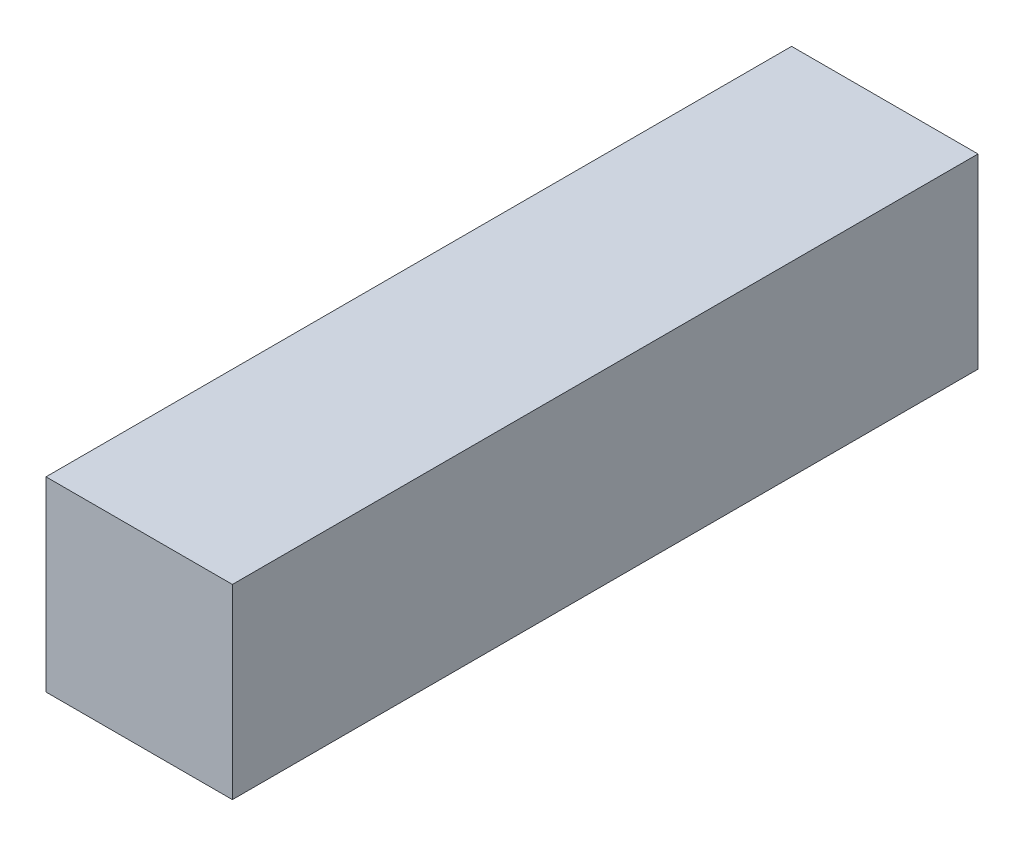
ISO-10303-21;
HEADER;
FILE_DESCRIPTION(('STEP AP214'),'2;1');
FILE_NAME('part.step','',(''),(''),'','','');
FILE_SCHEMA(('AUTOMOTIVE_DESIGN { 1 0 10303 214 1 1 1 1 }'));
ENDSEC;
DATA;
#1=APPLICATION_CONTEXT('core data for automotive mechanical design processes');
#2=APPLICATION_PROTOCOL_DEFINITION('international standard','automotive_design',2000,#1);
#3=PRODUCT_CONTEXT('',#1,'mechanical');
#4=PRODUCT('Part','Part','',(#3));
#5=PRODUCT_RELATED_PRODUCT_CATEGORY('part','',(#4));
#6=PRODUCT_DEFINITION_FORMATION('','',#4);
#7=PRODUCT_DEFINITION_CONTEXT('part definition',#1,'design');
#8=PRODUCT_DEFINITION('design','',#6,#7);
#9=PRODUCT_DEFINITION_SHAPE('','',#8);
#10=(LENGTH_UNIT() NAMED_UNIT(*) SI_UNIT(.MILLI.,.METRE.));
#11=(NAMED_UNIT(*) PLANE_ANGLE_UNIT() SI_UNIT($,.RADIAN.));
#12=(NAMED_UNIT(*) SI_UNIT($,.STERADIAN.) SOLID_ANGLE_UNIT());
#13=UNCERTAINTY_MEASURE_WITH_UNIT(LENGTH_MEASURE(1.E-05),#10,'distance_accuracy_value','');
#14=(GEOMETRIC_REPRESENTATION_CONTEXT(3) GLOBAL_UNCERTAINTY_ASSIGNED_CONTEXT((#13)) GLOBAL_UNIT_ASSIGNED_CONTEXT((#10,
#11,#12)) REPRESENTATION_CONTEXT('',''));
#15=CARTESIAN_POINT('',(0.,0.,0.));
#16=DIRECTION('',(0.,0.,1.));
#17=DIRECTION('',(1.,0.,0.));
#18=AXIS2_PLACEMENT_3D('',#15,#16,#17);
#19=CARTESIAN_POINT('',(152.4,0.,0.));
#20=DIRECTION('',(0.,0.,-1.));
#21=DIRECTION('',(0.,1.,0.));
#22=AXIS2_PLACEMENT_3D('',#19,#20,#21);
#23=PLANE('',#22);
#24=DIRECTION('',(0.,-1.,0.));
#25=VECTOR('',#24,1.);
#26=CARTESIAN_POINT('',(0.,0.,0.));
#27=LINE('',#26,#25);
#28=CARTESIAN_POINT('',(0.,152.4,5.22769947430191E-13));
#29=VERTEX_POINT('',#28);
#30=CARTESIAN_POINT('',(0.,0.,0.));
#31=VERTEX_POINT('',#30);
#32=EDGE_CURVE('E111',#29,#31,#27,.T.);
#33=ORIENTED_EDGE('',*,*,#32,.T.);
#34=DIRECTION('',(-1.,0.,0.));
#35=VECTOR('',#34,1.);
#36=CARTESIAN_POINT('',(152.4,0.,0.));
#37=LINE('',#36,#35);
#38=CARTESIAN_POINT('',(152.4,0.,0.));
#39=VERTEX_POINT('',#38);
#40=EDGE_CURVE('E11',#39,#31,#37,.T.);
#41=ORIENTED_EDGE('',*,*,#40,.F.);
#42=DIRECTION('',(0.,-1.,0.));
#43=VECTOR('',#42,1.);
#44=CARTESIAN_POINT('',(152.4,0.,0.));
#45=LINE('',#44,#43);
#46=CARTESIAN_POINT('',(152.4,152.4,5.22769947430191E-13));
#47=VERTEX_POINT('',#46);
#48=EDGE_CURVE('E95',#47,#39,#45,.T.);
#49=ORIENTED_EDGE('',*,*,#48,.F.);
#50=DIRECTION('',(-1.,0.,0.));
#51=VECTOR('',#50,1.);
#52=CARTESIAN_POINT('',(152.4,152.4,5.22769947430191E-13));
#53=LINE('',#52,#51);
#54=EDGE_CURVE('E107',#47,#29,#53,.T.);
#55=ORIENTED_EDGE('',*,*,#54,.T.);
#56=EDGE_LOOP('',(#33,#41,#49,#55));
#57=FACE_BOUND('',#56,.T.);
#58=ADVANCED_FACE('F43',(#57),#23,.F.);
#59=CARTESIAN_POINT('',(152.4,0.,0.));
#60=DIRECTION('',(0.,1.,0.));
#61=DIRECTION('',(0.,0.,1.));
#62=AXIS2_PLACEMENT_3D('',#59,#60,#61);
#63=PLANE('',#62);
#64=DIRECTION('',(0.,0.,-1.));
#65=VECTOR('',#64,1.);
#66=CARTESIAN_POINT('',(0.,0.,0.));
#67=LINE('',#66,#65);
#68=CARTESIAN_POINT('',(0.,0.,-609.6));
#69=VERTEX_POINT('',#68);
#70=EDGE_CURVE('E100',#31,#69,#67,.T.);
#71=ORIENTED_EDGE('',*,*,#70,.T.);
#72=DIRECTION('',(-1.,0.,0.));
#73=VECTOR('',#72,1.);
#74=CARTESIAN_POINT('',(152.4,0.,-609.6));
#75=LINE('',#74,#73);
#76=CARTESIAN_POINT('',(152.4,0.,-609.6));
#77=VERTEX_POINT('',#76);
#78=EDGE_CURVE('E52',#77,#69,#75,.T.);
#79=ORIENTED_EDGE('',*,*,#78,.F.);
#80=DIRECTION('',(0.,0.,-1.));
#81=VECTOR('',#80,1.);
#82=CARTESIAN_POINT('',(152.4,0.,0.));
#83=LINE('',#82,#81);
#84=EDGE_CURVE('E90',#39,#77,#83,.T.);
#85=ORIENTED_EDGE('',*,*,#84,.F.);
#86=ORIENTED_EDGE('',*,*,#40,.T.);
#87=EDGE_LOOP('',(#71,#79,#85,#86));
#88=FACE_BOUND('',#87,.T.);
#89=ADVANCED_FACE('F99',(#88),#63,.F.);
#90=CARTESIAN_POINT('',(152.4,0.,-609.6));
#91=DIRECTION('',(0.,0.,1.));
#92=DIRECTION('',(1.,0.,0.));
#93=AXIS2_PLACEMENT_3D('',#90,#91,#92);
#94=PLANE('',#93);
#95=DIRECTION('',(0.,1.,0.));
#96=VECTOR('',#95,1.);
#97=CARTESIAN_POINT('',(0.,0.,-609.6));
#98=LINE('',#97,#96);
#99=CARTESIAN_POINT('',(0.,152.4,-609.6));
#100=VERTEX_POINT('',#99);
#101=EDGE_CURVE('E77',#69,#100,#98,.T.);
#102=ORIENTED_EDGE('',*,*,#101,.T.);
#103=DIRECTION('',(-1.,0.,0.));
#104=VECTOR('',#103,1.);
#105=CARTESIAN_POINT('',(152.4,152.4,-609.6));
#106=LINE('',#105,#104);
#107=CARTESIAN_POINT('',(152.4,152.4,-609.6));
#108=VERTEX_POINT('',#107);
#109=EDGE_CURVE('E102',#108,#100,#106,.T.);
#110=ORIENTED_EDGE('',*,*,#109,.F.);
#111=DIRECTION('',(0.,1.,0.));
#112=VECTOR('',#111,1.);
#113=CARTESIAN_POINT('',(152.4,0.,-609.6));
#114=LINE('',#113,#112);
#115=EDGE_CURVE('E93',#77,#108,#114,.T.);
#116=ORIENTED_EDGE('',*,*,#115,.F.);
#117=ORIENTED_EDGE('',*,*,#78,.T.);
#118=EDGE_LOOP('',(#102,#110,#116,#117));
#119=FACE_BOUND('',#118,.T.);
#120=ADVANCED_FACE('F103',(#119),#94,.F.);
#121=CARTESIAN_POINT('',(152.4,152.4,5.22769947430191E-13));
#122=DIRECTION('',(0.,-1.,0.));
#123=DIRECTION('',(0.,0.,-1.));
#124=AXIS2_PLACEMENT_3D('',#121,#122,#123);
#125=PLANE('',#124);
#126=DIRECTION('',(0.,0.,1.));
#127=VECTOR('',#126,1.);
#128=CARTESIAN_POINT('',(0.,152.4,5.22769947430191E-13));
#129=LINE('',#128,#127);
#130=EDGE_CURVE('E83',#100,#29,#129,.T.);
#131=ORIENTED_EDGE('',*,*,#130,.T.);
#132=ORIENTED_EDGE('',*,*,#54,.F.);
#133=DIRECTION('',(0.,0.,1.));
#134=VECTOR('',#133,1.);
#135=CARTESIAN_POINT('',(152.4,152.4,5.22769947430191E-13));
#136=LINE('',#135,#134);
#137=EDGE_CURVE('E60',#108,#47,#136,.T.);
#138=ORIENTED_EDGE('',*,*,#137,.F.);
#139=ORIENTED_EDGE('',*,*,#109,.T.);
#140=EDGE_LOOP('',(#131,#132,#138,#139));
#141=FACE_BOUND('',#140,.T.);
#142=ADVANCED_FACE('F124',(#141),#125,.F.);
#143=CARTESIAN_POINT('',(152.4,0.,0.));
#144=DIRECTION('',(-1.,0.,0.));
#145=DIRECTION('',(0.,0.,1.));
#146=AXIS2_PLACEMENT_3D('',#143,#144,#145);
#147=PLANE('',#146);
#148=ORIENTED_EDGE('',*,*,#48,.T.);
#149=ORIENTED_EDGE('',*,*,#84,.T.);
#150=ORIENTED_EDGE('',*,*,#115,.T.);
#151=ORIENTED_EDGE('',*,*,#137,.T.);
#152=EDGE_LOOP('',(#148,#149,#150,#151));
#153=FACE_BOUND('',#152,.T.);
#154=ADVANCED_FACE('F91',(#153),#147,.F.);
#155=CARTESIAN_POINT('',(0.,0.,0.));
#156=DIRECTION('',(-1.,0.,0.));
#157=DIRECTION('',(0.,0.,1.));
#158=AXIS2_PLACEMENT_3D('',#155,#156,#157);
#159=PLANE('',#158);
#160=ORIENTED_EDGE('',*,*,#32,.F.);
#161=ORIENTED_EDGE('',*,*,#130,.F.);
#162=ORIENTED_EDGE('',*,*,#101,.F.);
#163=ORIENTED_EDGE('',*,*,#70,.F.);
#164=EDGE_LOOP('',(#160,#161,#162,#163));
#165=FACE_BOUND('',#164,.T.);
#166=ADVANCED_FACE('F127',(#165),#159,.T.);
#167=CLOSED_SHELL('',(#58,#89,#120,#142,#154,#166));
#168=MANIFOLD_SOLID_BREP('B2',#167);
#169=ADVANCED_BREP_SHAPE_REPRESENTATION('',(#18,#168),#14);
#170=SHAPE_DEFINITION_REPRESENTATION(#9,#169);
ENDSEC;
END-ISO-10303-21;
